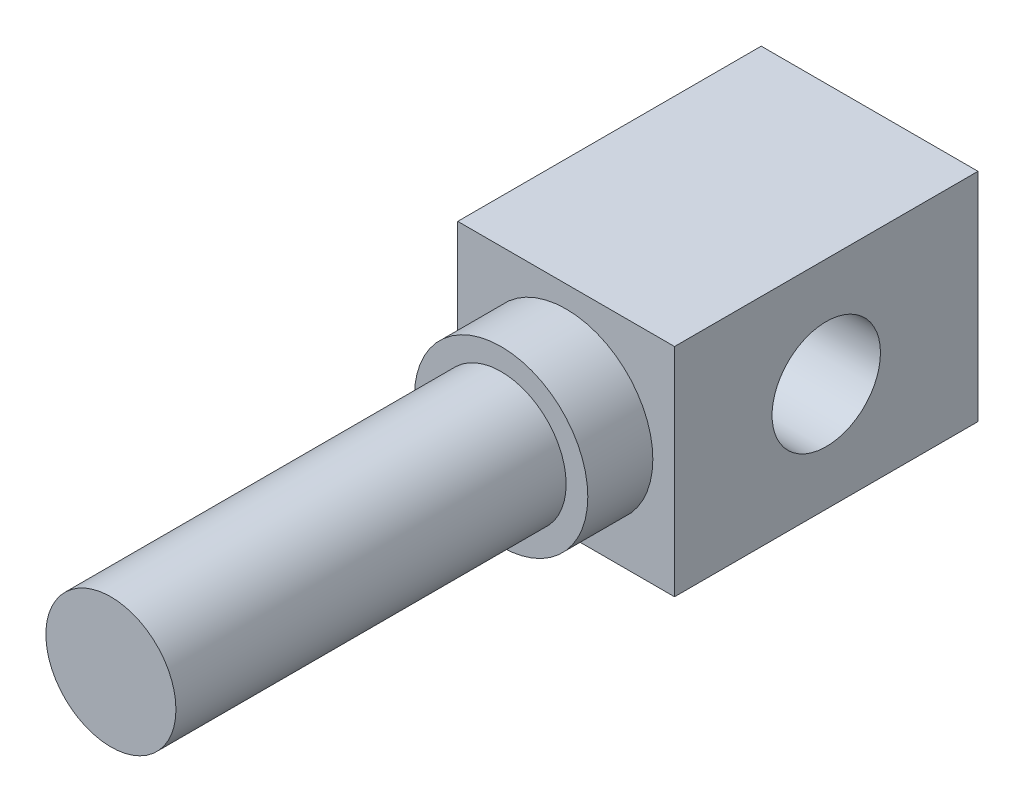
ISO-10303-21;
HEADER;
FILE_DESCRIPTION(('STEP AP214'),'2;1');
FILE_NAME('part.step','',(''),(''),'','','');
FILE_SCHEMA(('AUTOMOTIVE_DESIGN { 1 0 10303 214 1 1 1 1 }'));
ENDSEC;
DATA;
#1=APPLICATION_CONTEXT('core data for automotive mechanical design processes');
#2=APPLICATION_PROTOCOL_DEFINITION('international standard','automotive_design',2000,#1);
#3=PRODUCT_CONTEXT('',#1,'mechanical');
#4=PRODUCT('Part','Part','',(#3));
#5=PRODUCT_RELATED_PRODUCT_CATEGORY('part','',(#4));
#6=PRODUCT_DEFINITION_FORMATION('','',#4);
#7=PRODUCT_DEFINITION_CONTEXT('part definition',#1,'design');
#8=PRODUCT_DEFINITION('design','',#6,#7);
#9=PRODUCT_DEFINITION_SHAPE('','',#8);
#10=(LENGTH_UNIT() NAMED_UNIT(*) SI_UNIT(.MILLI.,.METRE.));
#11=(NAMED_UNIT(*) PLANE_ANGLE_UNIT() SI_UNIT($,.RADIAN.));
#12=(NAMED_UNIT(*) SI_UNIT($,.STERADIAN.) SOLID_ANGLE_UNIT());
#13=UNCERTAINTY_MEASURE_WITH_UNIT(LENGTH_MEASURE(1.E-05),#10,'distance_accuracy_value','');
#14=(GEOMETRIC_REPRESENTATION_CONTEXT(3) GLOBAL_UNCERTAINTY_ASSIGNED_CONTEXT((#13)) GLOBAL_UNIT_ASSIGNED_CONTEXT((#10,
#11,#12)) REPRESENTATION_CONTEXT('',''));
#15=CARTESIAN_POINT('',(0.,0.,0.));
#16=DIRECTION('',(0.,0.,1.));
#17=DIRECTION('',(1.,0.,0.));
#18=AXIS2_PLACEMENT_3D('',#15,#16,#17);
#19=CARTESIAN_POINT('',(2.5,2.5,8.5));
#20=DIRECTION('',(0.,0.,1.));
#21=DIRECTION('',(1.,0.,0.));
#22=AXIS2_PLACEMENT_3D('',#19,#20,#21);
#23=PLANE('',#22);
#24=CARTESIAN_POINT('',(2.5,2.5,8.5));
#25=DIRECTION('',(0.,0.,1.));
#26=DIRECTION('',(1.,0.,0.));
#27=AXIS2_PLACEMENT_3D('',#24,#25,#26);
#28=CIRCLE('',#27,2.);
#29=CARTESIAN_POINT('',(4.5,2.5,8.5));
#30=VERTEX_POINT('',#29);
#31=EDGE_CURVE('E105',#30,#30,#28,.T.);
#32=ORIENTED_EDGE('',*,*,#31,.T.);
#33=EDGE_LOOP('',(#32));
#34=FACE_BOUND('',#33,.T.);
#35=CARTESIAN_POINT('',(2.5,2.5,8.5));
#36=DIRECTION('',(0.,0.,1.));
#37=DIRECTION('',(1.,0.,0.));
#38=AXIS2_PLACEMENT_3D('',#35,#36,#37);
#39=CIRCLE('',#38,1.5);
#40=CARTESIAN_POINT('',(4.,2.5,8.5));
#41=VERTEX_POINT('',#40);
#42=EDGE_CURVE('E156',#41,#41,#39,.T.);
#43=ORIENTED_EDGE('',*,*,#42,.F.);
#44=EDGE_LOOP('',(#43));
#45=FACE_BOUND('',#44,.T.);
#46=ADVANCED_FACE('F34',(#34,#45),#23,.T.);
#47=CARTESIAN_POINT('',(0.,5.,7.));
#48=DIRECTION('',(0.,0.,-1.));
#49=DIRECTION('',(-1.,0.,0.));
#50=AXIS2_PLACEMENT_3D('',#47,#48,#49);
#51=PLANE('',#50);
#52=DIRECTION('',(0.,-1.,0.));
#53=VECTOR('',#52,1.);
#54=CARTESIAN_POINT('',(0.,0.,7.));
#55=LINE('',#54,#53);
#56=CARTESIAN_POINT('',(0.,5.,7.));
#57=VERTEX_POINT('',#56);
#58=CARTESIAN_POINT('',(0.,0.,7.));
#59=VERTEX_POINT('',#58);
#60=EDGE_CURVE('E88',#57,#59,#55,.T.);
#61=ORIENTED_EDGE('',*,*,#60,.T.);
#62=DIRECTION('',(1.,0.,0.));
#63=VECTOR('',#62,1.);
#64=CARTESIAN_POINT('',(0.,0.,7.));
#65=LINE('',#64,#63);
#66=CARTESIAN_POINT('',(5.,0.,7.));
#67=VERTEX_POINT('',#66);
#68=EDGE_CURVE('E82',#59,#67,#65,.T.);
#69=ORIENTED_EDGE('',*,*,#68,.T.);
#70=DIRECTION('',(0.,1.,0.));
#71=VECTOR('',#70,1.);
#72=CARTESIAN_POINT('',(5.,0.,7.));
#73=LINE('',#72,#71);
#74=CARTESIAN_POINT('',(5.,5.,7.));
#75=VERTEX_POINT('',#74);
#76=EDGE_CURVE('E86',#67,#75,#73,.T.);
#77=ORIENTED_EDGE('',*,*,#76,.T.);
#78=DIRECTION('',(-1.,0.,0.));
#79=VECTOR('',#78,1.);
#80=CARTESIAN_POINT('',(0.,5.,7.));
#81=LINE('',#80,#79);
#82=EDGE_CURVE('E51',#75,#57,#81,.T.);
#83=ORIENTED_EDGE('',*,*,#82,.T.);
#84=EDGE_LOOP('',(#61,#69,#77,#83));
#85=FACE_BOUND('',#84,.T.);
#86=CARTESIAN_POINT('',(2.5,2.5,7.));
#87=DIRECTION('',(0.,0.,-1.));
#88=DIRECTION('',(-1.,0.,0.));
#89=AXIS2_PLACEMENT_3D('',#86,#87,#88);
#90=CIRCLE('',#89,2.);
#91=CARTESIAN_POINT('',(0.5,2.5,7.));
#92=VERTEX_POINT('',#91);
#93=EDGE_CURVE('E11',#92,#92,#90,.F.);
#94=ORIENTED_EDGE('',*,*,#93,.F.);
#95=EDGE_LOOP('',(#94));
#96=FACE_BOUND('',#95,.T.);
#97=ADVANCED_FACE('F83',(#85,#96),#51,.F.);
#98=CARTESIAN_POINT('',(0.,0.,7.));
#99=DIRECTION('',(1.,0.,0.));
#100=DIRECTION('',(0.,0.,-1.));
#101=AXIS2_PLACEMENT_3D('',#98,#99,#100);
#102=PLANE('',#101);
#103=CARTESIAN_POINT('',(0.,2.5,3.5));
#104=DIRECTION('',(1.,0.,0.));
#105=DIRECTION('',(0.,0.,-1.));
#106=AXIS2_PLACEMENT_3D('',#103,#104,#105);
#107=CIRCLE('',#106,1.24999999999999);
#108=CARTESIAN_POINT('',(0.,2.5,2.25000000000001));
#109=VERTEX_POINT('',#108);
#110=EDGE_CURVE('E154',#109,#109,#107,.T.);
#111=ORIENTED_EDGE('',*,*,#110,.T.);
#112=EDGE_LOOP('',(#111));
#113=FACE_BOUND('',#112,.T.);
#114=DIRECTION('',(0.,-1.,0.));
#115=VECTOR('',#114,1.);
#116=CARTESIAN_POINT('',(0.,0.,0.));
#117=LINE('',#116,#115);
#118=CARTESIAN_POINT('',(0.,5.,0.));
#119=VERTEX_POINT('',#118);
#120=CARTESIAN_POINT('',(0.,0.,0.));
#121=VERTEX_POINT('',#120);
#122=EDGE_CURVE('E102',#119,#121,#117,.T.);
#123=ORIENTED_EDGE('',*,*,#122,.T.);
#124=DIRECTION('',(0.,0.,-1.));
#125=VECTOR('',#124,1.);
#126=CARTESIAN_POINT('',(0.,0.,7.));
#127=LINE('',#126,#125);
#128=EDGE_CURVE('E43',#59,#121,#127,.T.);
#129=ORIENTED_EDGE('',*,*,#128,.F.);
#130=ORIENTED_EDGE('',*,*,#60,.F.);
#131=DIRECTION('',(0.,0.,-1.));
#132=VECTOR('',#131,1.);
#133=CARTESIAN_POINT('',(0.,5.,7.));
#134=LINE('',#133,#132);
#135=EDGE_CURVE('E98',#57,#119,#134,.T.);
#136=ORIENTED_EDGE('',*,*,#135,.T.);
#137=EDGE_LOOP('',(#123,#129,#130,#136));
#138=FACE_BOUND('',#137,.T.);
#139=ADVANCED_FACE('F36',(#113,#138),#102,.F.);
#140=CARTESIAN_POINT('',(0.,0.,7.));
#141=DIRECTION('',(0.,1.,0.));
#142=DIRECTION('',(0.,0.,1.));
#143=AXIS2_PLACEMENT_3D('',#140,#141,#142);
#144=PLANE('',#143);
#145=DIRECTION('',(1.,0.,0.));
#146=VECTOR('',#145,1.);
#147=CARTESIAN_POINT('',(0.,0.,0.));
#148=LINE('',#147,#146);
#149=CARTESIAN_POINT('',(5.,0.,0.));
#150=VERTEX_POINT('',#149);
#151=EDGE_CURVE('E93',#121,#150,#148,.T.);
#152=ORIENTED_EDGE('',*,*,#151,.T.);
#153=DIRECTION('',(0.,0.,-1.));
#154=VECTOR('',#153,1.);
#155=CARTESIAN_POINT('',(5.,0.,7.));
#156=LINE('',#155,#154);
#157=EDGE_CURVE('E91',#67,#150,#156,.T.);
#158=ORIENTED_EDGE('',*,*,#157,.F.);
#159=ORIENTED_EDGE('',*,*,#68,.F.);
#160=ORIENTED_EDGE('',*,*,#128,.T.);
#161=EDGE_LOOP('',(#152,#158,#159,#160));
#162=FACE_BOUND('',#161,.T.);
#163=ADVANCED_FACE('F92',(#162),#144,.F.);
#164=CARTESIAN_POINT('',(5.,0.,7.));
#165=DIRECTION('',(-1.,0.,0.));
#166=DIRECTION('',(0.,0.,1.));
#167=AXIS2_PLACEMENT_3D('',#164,#165,#166);
#168=PLANE('',#167);
#169=CARTESIAN_POINT('',(5.,2.5,3.5));
#170=DIRECTION('',(1.,0.,0.));
#171=DIRECTION('',(0.,0.,-1.));
#172=AXIS2_PLACEMENT_3D('',#169,#170,#171);
#173=CIRCLE('',#172,1.24999999999999);
#174=CARTESIAN_POINT('',(5.,2.5,2.25000000000001));
#175=VERTEX_POINT('',#174);
#176=EDGE_CURVE('E151',#175,#175,#173,.T.);
#177=ORIENTED_EDGE('',*,*,#176,.F.);
#178=EDGE_LOOP('',(#177));
#179=FACE_BOUND('',#178,.T.);
#180=DIRECTION('',(0.,1.,0.));
#181=VECTOR('',#180,1.);
#182=CARTESIAN_POINT('',(5.,0.,0.));
#183=LINE('',#182,#181);
#184=CARTESIAN_POINT('',(5.,5.,0.));
#185=VERTEX_POINT('',#184);
#186=EDGE_CURVE('E68',#150,#185,#183,.T.);
#187=ORIENTED_EDGE('',*,*,#186,.T.);
#188=DIRECTION('',(0.,0.,-1.));
#189=VECTOR('',#188,1.);
#190=CARTESIAN_POINT('',(5.,5.,7.));
#191=LINE('',#190,#189);
#192=EDGE_CURVE('E94',#75,#185,#191,.T.);
#193=ORIENTED_EDGE('',*,*,#192,.F.);
#194=ORIENTED_EDGE('',*,*,#76,.F.);
#195=ORIENTED_EDGE('',*,*,#157,.T.);
#196=EDGE_LOOP('',(#187,#193,#194,#195));
#197=FACE_BOUND('',#196,.T.);
#198=ADVANCED_FACE('F96',(#179,#197),#168,.F.);
#199=CARTESIAN_POINT('',(0.,5.,7.));
#200=DIRECTION('',(0.,-1.,0.));
#201=DIRECTION('',(1.,0.,0.));
#202=AXIS2_PLACEMENT_3D('',#199,#200,#201);
#203=PLANE('',#202);
#204=DIRECTION('',(-1.,0.,0.));
#205=VECTOR('',#204,1.);
#206=CARTESIAN_POINT('',(0.,5.,0.));
#207=LINE('',#206,#205);
#208=EDGE_CURVE('E74',#185,#119,#207,.T.);
#209=ORIENTED_EDGE('',*,*,#208,.T.);
#210=ORIENTED_EDGE('',*,*,#135,.F.);
#211=ORIENTED_EDGE('',*,*,#82,.F.);
#212=ORIENTED_EDGE('',*,*,#192,.T.);
#213=EDGE_LOOP('',(#209,#210,#211,#212));
#214=FACE_BOUND('',#213,.T.);
#215=ADVANCED_FACE('F116',(#214),#203,.F.);
#216=CARTESIAN_POINT('',(0.,5.,0.));
#217=DIRECTION('',(0.,0.,-1.));
#218=DIRECTION('',(-1.,0.,0.));
#219=AXIS2_PLACEMENT_3D('',#216,#217,#218);
#220=PLANE('',#219);
#221=ORIENTED_EDGE('',*,*,#122,.F.);
#222=ORIENTED_EDGE('',*,*,#208,.F.);
#223=ORIENTED_EDGE('',*,*,#186,.F.);
#224=ORIENTED_EDGE('',*,*,#151,.F.);
#225=EDGE_LOOP('',(#221,#222,#223,#224));
#226=FACE_BOUND('',#225,.T.);
#227=ADVANCED_FACE('F113',(#226),#220,.T.);
#228=CARTESIAN_POINT('',(2.5,2.5,8.5));
#229=DIRECTION('',(0.,0.,-1.));
#230=DIRECTION('',(-1.,0.,0.));
#231=AXIS2_PLACEMENT_3D('',#228,#229,#230);
#232=CYLINDRICAL_SURFACE('',#231,2.);
#233=ORIENTED_EDGE('',*,*,#31,.F.);
#234=EDGE_LOOP('',(#233));
#235=FACE_BOUND('',#234,.T.);
#236=ORIENTED_EDGE('',*,*,#93,.T.);
#237=EDGE_LOOP('',(#236));
#238=FACE_BOUND('',#237,.T.);
#239=ADVANCED_FACE('F115',(#235,#238),#232,.T.);
#240=CARTESIAN_POINT('',(2.5,2.5,17.5));
#241=DIRECTION('',(0.,0.,-1.));
#242=DIRECTION('',(-1.,0.,0.));
#243=AXIS2_PLACEMENT_3D('',#240,#241,#242);
#244=CYLINDRICAL_SURFACE('',#243,1.5);
#245=CARTESIAN_POINT('',(2.5,2.5,17.5));
#246=DIRECTION('',(0.,0.,1.));
#247=DIRECTION('',(1.,0.,0.));
#248=AXIS2_PLACEMENT_3D('',#245,#246,#247);
#249=CIRCLE('',#248,1.5);
#250=CARTESIAN_POINT('',(4.,2.5,17.5));
#251=VERTEX_POINT('',#250);
#252=EDGE_CURVE('E159',#251,#251,#249,.T.);
#253=ORIENTED_EDGE('',*,*,#252,.F.);
#254=EDGE_LOOP('',(#253));
#255=FACE_BOUND('',#254,.T.);
#256=ORIENTED_EDGE('',*,*,#42,.T.);
#257=EDGE_LOOP('',(#256));
#258=FACE_BOUND('',#257,.T.);
#259=ADVANCED_FACE('F122',(#255,#258),#244,.T.);
#260=CARTESIAN_POINT('',(2.5,2.5,17.5));
#261=DIRECTION('',(0.,0.,1.));
#262=DIRECTION('',(1.,0.,0.));
#263=AXIS2_PLACEMENT_3D('',#260,#261,#262);
#264=PLANE('',#263);
#265=ORIENTED_EDGE('',*,*,#252,.T.);
#266=EDGE_LOOP('',(#265));
#267=FACE_BOUND('',#266,.T.);
#268=ADVANCED_FACE('F138',(#267),#264,.T.);
#269=CARTESIAN_POINT('',(5.,2.5,3.5));
#270=DIRECTION('',(1.,0.,0.));
#271=DIRECTION('',(0.,0.,-1.));
#272=AXIS2_PLACEMENT_3D('',#269,#270,#271);
#273=CYLINDRICAL_SURFACE('',#272,1.24999999999999);
#274=ORIENTED_EDGE('',*,*,#176,.T.);
#275=EDGE_LOOP('',(#274));
#276=FACE_BOUND('',#275,.T.);
#277=ORIENTED_EDGE('',*,*,#110,.F.);
#278=EDGE_LOOP('',(#277));
#279=FACE_BOUND('',#278,.T.);
#280=ADVANCED_FACE('F142',(#276,#279),#273,.F.);
#281=CLOSED_SHELL('',(#46,#97,#139,#163,#198,#215,#227,#239,#259,#268,#280));
#282=MANIFOLD_SOLID_BREP('B2',#281);
#283=ADVANCED_BREP_SHAPE_REPRESENTATION('',(#18,#282),#14);
#284=SHAPE_DEFINITION_REPRESENTATION(#9,#283);
ENDSEC;
END-ISO-10303-21;
